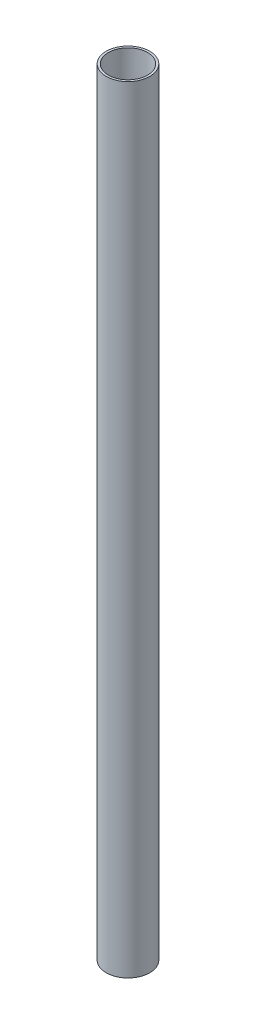
ISO-10303-21;
HEADER;
FILE_DESCRIPTION(('STEP AP214'),'2;1');
FILE_NAME('part.step','',(''),(''),'','','');
FILE_SCHEMA(('AUTOMOTIVE_DESIGN { 1 0 10303 214 1 1 1 1 }'));
ENDSEC;
DATA;
#1=APPLICATION_CONTEXT('core data for automotive mechanical design processes');
#2=APPLICATION_PROTOCOL_DEFINITION('international standard','automotive_design',2000,#1);
#3=PRODUCT_CONTEXT('',#1,'mechanical');
#4=PRODUCT('Part','Part','',(#3));
#5=PRODUCT_RELATED_PRODUCT_CATEGORY('part','',(#4));
#6=PRODUCT_DEFINITION_FORMATION('','',#4);
#7=PRODUCT_DEFINITION_CONTEXT('part definition',#1,'design');
#8=PRODUCT_DEFINITION('design','',#6,#7);
#9=PRODUCT_DEFINITION_SHAPE('','',#8);
#10=(LENGTH_UNIT() NAMED_UNIT(*) SI_UNIT(.MILLI.,.METRE.));
#11=(NAMED_UNIT(*) PLANE_ANGLE_UNIT() SI_UNIT($,.RADIAN.));
#12=(NAMED_UNIT(*) SI_UNIT($,.STERADIAN.) SOLID_ANGLE_UNIT());
#13=UNCERTAINTY_MEASURE_WITH_UNIT(LENGTH_MEASURE(1.E-05),#10,'distance_accuracy_value','');
#14=(GEOMETRIC_REPRESENTATION_CONTEXT(3) GLOBAL_UNCERTAINTY_ASSIGNED_CONTEXT((#13)) GLOBAL_UNIT_ASSIGNED_CONTEXT((#10,
#11,#12)) REPRESENTATION_CONTEXT('',''));
#15=CARTESIAN_POINT('',(0.,0.,0.));
#16=DIRECTION('',(0.,0.,1.));
#17=DIRECTION('',(1.,0.,0.));
#18=AXIS2_PLACEMENT_3D('',#15,#16,#17);
#19=CARTESIAN_POINT('',(0.,18.,0.));
#20=DIRECTION('',(0.,1.,0.));
#21=DIRECTION('',(0.,0.,1.));
#22=AXIS2_PLACEMENT_3D('',#19,#20,#21);
#23=CYLINDRICAL_SURFACE('',#22,2.25);
#24=CARTESIAN_POINT('',(0.,18.,0.));
#25=DIRECTION('',(0.,1.,0.));
#26=DIRECTION('',(0.,0.,1.));
#27=AXIS2_PLACEMENT_3D('',#24,#25,#26);
#28=CIRCLE('',#27,2.25);
#29=CARTESIAN_POINT('',(0.,18.,2.25));
#30=VERTEX_POINT('',#29);
#31=EDGE_CURVE('E11',#30,#30,#28,.T.);
#32=ORIENTED_EDGE('',*,*,#31,.T.);
#33=EDGE_LOOP('',(#32));
#34=FACE_BOUND('',#33,.T.);
#35=CARTESIAN_POINT('',(0.,84.,1.94289029309402E-13));
#36=DIRECTION('',(0.,1.,0.));
#37=DIRECTION('',(0.,0.,1.));
#38=AXIS2_PLACEMENT_3D('',#35,#36,#37);
#39=CIRCLE('',#38,2.25);
#40=CARTESIAN_POINT('',(0.,84.,2.25000000000019));
#41=VERTEX_POINT('',#40);
#42=EDGE_CURVE('E47',#41,#41,#39,.T.);
#43=ORIENTED_EDGE('',*,*,#42,.F.);
#44=EDGE_LOOP('',(#43));
#45=FACE_BOUND('',#44,.T.);
#46=ADVANCED_FACE('F44',(#34,#45),#23,.T.);
#47=CARTESIAN_POINT('',(0.,18.,0.));
#48=DIRECTION('',(0.,1.,0.));
#49=DIRECTION('',(0.,0.,1.));
#50=AXIS2_PLACEMENT_3D('',#47,#48,#49);
#51=PLANE('',#50);
#52=ORIENTED_EDGE('',*,*,#31,.F.);
#53=EDGE_LOOP('',(#52));
#54=FACE_BOUND('',#53,.T.);
#55=ADVANCED_FACE('F59',(#54),#51,.F.);
#56=CARTESIAN_POINT('',(0.,84.,1.94289029309402E-13));
#57=DIRECTION('',(0.,1.,0.));
#58=DIRECTION('',(0.,0.,1.));
#59=AXIS2_PLACEMENT_3D('',#56,#57,#58);
#60=PLANE('',#59);
#61=ORIENTED_EDGE('',*,*,#42,.T.);
#62=EDGE_LOOP('',(#61));
#63=FACE_BOUND('',#62,.T.);
#64=ADVANCED_FACE('F56',(#63),#60,.T.);
#65=CLOSED_SHELL('',(#46,#55,#64));
#66=MANIFOLD_SOLID_BREP('B2',#65);
#67=CARTESIAN_POINT('',(0.,89.,1.94289029309402E-13));
#68=DIRECTION('',(0.,1.,0.));
#69=DIRECTION('',(0.,0.,1.));
#70=AXIS2_PLACEMENT_3D('',#67,#68,#69);
#71=PLANE('',#70);
#72=CARTESIAN_POINT('',(0.,89.,1.94289029309402E-13));
#73=DIRECTION('',(0.,1.,0.));
#74=DIRECTION('',(0.,0.,1.));
#75=AXIS2_PLACEMENT_3D('',#72,#73,#74);
#76=CIRCLE('',#75,2.5);
#77=CARTESIAN_POINT('',(0.,89.,2.50000000000019));
#78=VERTEX_POINT('',#77);
#79=EDGE_CURVE('E43',#78,#78,#76,.T.);
#80=ORIENTED_EDGE('',*,*,#79,.T.);
#81=EDGE_LOOP('',(#80));
#82=FACE_BOUND('',#81,.T.);
#83=CARTESIAN_POINT('',(0.,89.,1.94289029309402E-13));
#84=DIRECTION('',(0.,1.,0.));
#85=DIRECTION('',(0.,0.,1.));
#86=AXIS2_PLACEMENT_3D('',#83,#84,#85);
#87=CIRCLE('',#86,2.25);
#88=CARTESIAN_POINT('',(0.,89.,2.25000000000019));
#89=VERTEX_POINT('',#88);
#90=EDGE_CURVE('E95',#89,#89,#87,.T.);
#91=ORIENTED_EDGE('',*,*,#90,.F.);
#92=EDGE_LOOP('',(#91));
#93=FACE_BOUND('',#92,.T.);
#94=ADVANCED_FACE('F84',(#82,#93),#71,.T.);
#95=CARTESIAN_POINT('',(0.,0.,0.));
#96=DIRECTION('',(0.,1.,0.));
#97=DIRECTION('',(0.,0.,1.));
#98=AXIS2_PLACEMENT_3D('',#95,#96,#97);
#99=PLANE('',#98);
#100=CARTESIAN_POINT('',(0.,0.,0.));
#101=DIRECTION('',(0.,1.,0.));
#102=DIRECTION('',(0.,0.,1.));
#103=AXIS2_PLACEMENT_3D('',#100,#101,#102);
#104=CIRCLE('',#103,2.5);
#105=CARTESIAN_POINT('',(0.,0.,2.5));
#106=VERTEX_POINT('',#105);
#107=EDGE_CURVE('E88',#106,#106,#104,.T.);
#108=ORIENTED_EDGE('',*,*,#107,.F.);
#109=EDGE_LOOP('',(#108));
#110=FACE_BOUND('',#109,.T.);
#111=CARTESIAN_POINT('',(0.,0.,0.));
#112=DIRECTION('',(0.,1.,0.));
#113=DIRECTION('',(0.,0.,1.));
#114=AXIS2_PLACEMENT_3D('',#111,#112,#113);
#115=CIRCLE('',#114,2.25);
#116=CARTESIAN_POINT('',(0.,0.,2.25));
#117=VERTEX_POINT('',#116);
#118=EDGE_CURVE('E97',#117,#117,#115,.T.);
#119=ORIENTED_EDGE('',*,*,#118,.T.);
#120=EDGE_LOOP('',(#119));
#121=FACE_BOUND('',#120,.T.);
#122=ADVANCED_FACE('F107',(#110,#121),#99,.F.);
#123=CARTESIAN_POINT('',(0.,89.,1.94289029309402E-13));
#124=DIRECTION('',(0.,-1.,0.));
#125=DIRECTION('',(0.,0.,-1.));
#126=AXIS2_PLACEMENT_3D('',#123,#124,#125);
#127=CYLINDRICAL_SURFACE('',#126,2.5);
#128=ORIENTED_EDGE('',*,*,#79,.F.);
#129=EDGE_LOOP('',(#128));
#130=FACE_BOUND('',#129,.T.);
#131=ORIENTED_EDGE('',*,*,#107,.T.);
#132=EDGE_LOOP('',(#131));
#133=FACE_BOUND('',#132,.T.);
#134=ADVANCED_FACE('F86',(#130,#133),#127,.T.);
#135=CARTESIAN_POINT('',(0.,89.,1.94289029309402E-13));
#136=DIRECTION('',(0.,-1.,0.));
#137=DIRECTION('',(0.,0.,-1.));
#138=AXIS2_PLACEMENT_3D('',#135,#136,#137);
#139=CYLINDRICAL_SURFACE('',#138,2.25);
#140=ORIENTED_EDGE('',*,*,#90,.T.);
#141=EDGE_LOOP('',(#140));
#142=FACE_BOUND('',#141,.T.);
#143=ORIENTED_EDGE('',*,*,#118,.F.);
#144=EDGE_LOOP('',(#143));
#145=FACE_BOUND('',#144,.T.);
#146=ADVANCED_FACE('F103',(#142,#145),#139,.F.);
#147=CLOSED_SHELL('',(#94,#122,#134,#146));
#148=MANIFOLD_SOLID_BREP('B6',#147);
#149=ADVANCED_BREP_SHAPE_REPRESENTATION('',(#18,#66,#148),#14);
#150=SHAPE_DEFINITION_REPRESENTATION(#9,#149);
ENDSEC;
END-ISO-10303-21;
